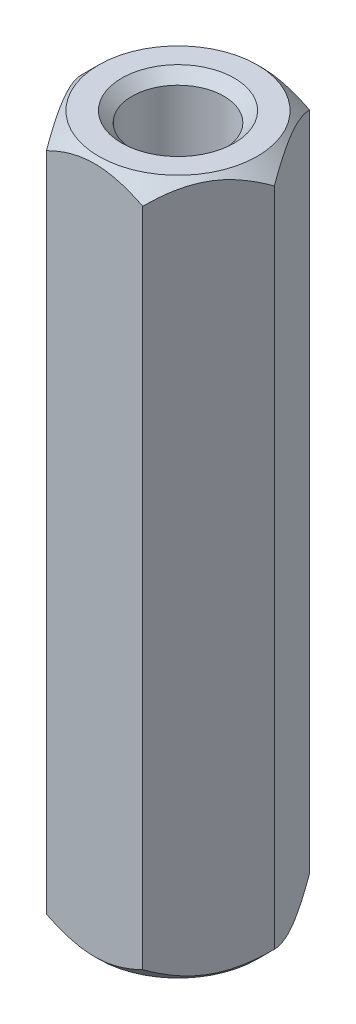
ISO-10303-21;
HEADER;
FILE_DESCRIPTION(('STEP AP214'),'2;1');
FILE_NAME('part.step','',(''),(''),'','','');
FILE_SCHEMA(('AUTOMOTIVE_DESIGN { 1 0 10303 214 1 1 1 1 }'));
ENDSEC;
DATA;
#1=APPLICATION_CONTEXT('core data for automotive mechanical design processes');
#2=APPLICATION_PROTOCOL_DEFINITION('international standard','automotive_design',2000,#1);
#3=PRODUCT_CONTEXT('',#1,'mechanical');
#4=PRODUCT('Part','Part','',(#3));
#5=PRODUCT_RELATED_PRODUCT_CATEGORY('part','',(#4));
#6=PRODUCT_DEFINITION_FORMATION('','',#4);
#7=PRODUCT_DEFINITION_CONTEXT('part definition',#1,'design');
#8=PRODUCT_DEFINITION('design','',#6,#7);
#9=PRODUCT_DEFINITION_SHAPE('','',#8);
#10=(LENGTH_UNIT() NAMED_UNIT(*) SI_UNIT(.MILLI.,.METRE.));
#11=(NAMED_UNIT(*) PLANE_ANGLE_UNIT() SI_UNIT($,.RADIAN.));
#12=(NAMED_UNIT(*) SI_UNIT($,.STERADIAN.) SOLID_ANGLE_UNIT());
#13=UNCERTAINTY_MEASURE_WITH_UNIT(LENGTH_MEASURE(1.E-05),#10,'distance_accuracy_value','');
#14=(GEOMETRIC_REPRESENTATION_CONTEXT(3) GLOBAL_UNCERTAINTY_ASSIGNED_CONTEXT((#13)) GLOBAL_UNIT_ASSIGNED_CONTEXT((#10,
#11,#12)) REPRESENTATION_CONTEXT('',''));
#15=CARTESIAN_POINT('',(0.,0.,0.));
#16=DIRECTION('',(0.,0.,1.));
#17=DIRECTION('',(1.,0.,0.));
#18=AXIS2_PLACEMENT_3D('',#15,#16,#17);
#19=CARTESIAN_POINT('',(3.46410161513775,25.,0.));
#20=DIRECTION('',(-0.866025403784438,0.,0.5));
#21=DIRECTION('',(0.5,0.,0.866025403784439));
#22=AXIS2_PLACEMENT_3D('',#19,#20,#21);
#23=PLANE('',#22);
#24=CARTESIAN_POINT('',(3.46421708519159,24.3857829090351,0.000199999999999765));
#25=CARTESIAN_POINT('',(3.40467869607211,24.4452700665405,-0.10292351495575));
#26=CARTESIAN_POINT('',(3.3441447475778,24.5012634053967,-0.207771389330652));
#27=CARTESIAN_POINT('',(3.22070940635329,24.6037857884833,-0.4215676717811));
#28=CARTESIAN_POINT('',(3.15779627521275,24.650257791121,-0.530536411379764));
#29=CARTESIAN_POINT('',(3.03093496880241,24.729865196346,-0.750266639597034));
#30=CARTESIAN_POINT('',(2.96701910000606,24.7632006842196,-0.860972171762219));
#31=CARTESIAN_POINT('',(2.83778025907546,24.8145608408829,-1.08482041056533));
#32=CARTESIAN_POINT('',(2.77246123486019,24.8326238473267,-1.197956279207));
#33=CARTESIAN_POINT('',(2.65988677911464,24.8489214764118,-1.39294095619271));
#34=CARTESIAN_POINT('',(2.6127767304643,24.8513340176884,-1.47453795400215));
#35=CARTESIAN_POINT('',(2.51863325954797,24.8472689502051,-1.6375992288301));
#36=CARTESIAN_POINT('',(2.47159986993093,24.8407882248339,-1.719063449299));
#37=CARTESIAN_POINT('',(2.37797867687425,24.819306662347,-1.88122011233839));
#38=CARTESIAN_POINT('',(2.33139143122688,24.804296294895,-1.96191158878432));
#39=CARTESIAN_POINT('',(2.23901705721437,24.7665747387962,-2.12190869789135));
#40=CARTESIAN_POINT('',(2.19322986779048,24.7438641405394,-2.20121443630932));
#41=CARTESIAN_POINT('',(2.11194373930152,24.6971377000083,-2.34200614080277));
#42=CARTESIAN_POINT('',(2.07626488907771,24.6743500571814,-2.40380372214604));
#43=CARTESIAN_POINT('',(2.00554773988154,24.6251020988048,-2.52628941752023));
#44=CARTESIAN_POINT('',(1.97050946049033,24.5986416711961,-2.58697749763562));
#45=CARTESIAN_POINT('',(1.90118383838355,24.5426413904709,-2.70705299739087));
#46=CARTESIAN_POINT('',(1.86689452386372,24.5131112203839,-2.76644383229592));
#47=CARTESIAN_POINT('',(1.79895094584794,24.4513592932867,-2.88412556146727));
#48=CARTESIAN_POINT('',(1.76529630793216,24.4191391882029,-2.94241710424774));
#49=CARTESIAN_POINT('',(1.73193533751504,24.3857829090351,-3.0002));
#50=B_SPLINE_CURVE_WITH_KNOTS('',3,(#24,#25,#26,#27,#28,#29,#30,#31,#32,#33,#34,#35,#36,#37,#38,
#39,#40,#41,#42,#43,#44,#45,#46,#47,#48,#49),.UNSPECIFIED.,.F.,.F.,(4,2,2,2,2,2,2,2,2,2,2,2,4),
(0.,0.399603557139309,0.80153528639785,1.19708369162344,1.59163620080174,1.87398941755845,
2.15644160919094,2.43921001247427,2.7219567403214,2.94657516661928,3.17120044767275,
3.3951375283781,3.61893808380739),.UNSPECIFIED.);
#51=CARTESIAN_POINT('',(3.46410161513775,24.3858983848623,0.));
#52=VERTEX_POINT('',#51);
#53=CARTESIAN_POINT('',(1.73205080756888,24.3858983848623,-3.));
#54=VERTEX_POINT('',#53);
#55=EDGE_CURVE('E193',#52,#54,#50,.T.);
#56=ORIENTED_EDGE('',*,*,#55,.F.);
#57=DIRECTION('',(0.,-1.,0.));
#58=VECTOR('',#57,1.);
#59=CARTESIAN_POINT('',(3.46410161513775,25.,0.));
#60=LINE('',#59,#58);
#61=CARTESIAN_POINT('',(3.46410161513775,0.614101615137745,0.));
#62=VERTEX_POINT('',#61);
#63=EDGE_CURVE('E58',#52,#62,#60,.T.);
#64=ORIENTED_EDGE('',*,*,#63,.T.);
#65=CARTESIAN_POINT('',(1.73193533751504,0.614217090964893,-3.0002));
#66=CARTESIAN_POINT('',(1.79147372663452,0.55472993345953,-2.89707648504425));
#67=CARTESIAN_POINT('',(1.85200767512883,0.498736594603263,-2.79222861066935));
#68=CARTESIAN_POINT('',(1.97544301635334,0.396214211516686,-2.5784323282189));
#69=CARTESIAN_POINT('',(2.03835614749388,0.349742208879036,-2.46946358862024));
#70=CARTESIAN_POINT('',(2.16521745390422,0.270134803654043,-2.24973336040297));
#71=CARTESIAN_POINT('',(2.22913332270057,0.236799315780413,-2.13902782823778));
#72=CARTESIAN_POINT('',(2.35837216363117,0.185439159117052,-1.91517958943467));
#73=CARTESIAN_POINT('',(2.42369118784644,0.16737615267335,-1.802043720793));
#74=CARTESIAN_POINT('',(2.53626564359199,0.151078523588245,-1.60705904380729));
#75=CARTESIAN_POINT('',(2.58337569224234,0.148665982311555,-1.52546204599786));
#76=CARTESIAN_POINT('',(2.67751916315866,0.152731049794863,-1.3624007711699));
#77=CARTESIAN_POINT('',(2.7245525527757,0.159211775166056,-1.280936550701));
#78=CARTESIAN_POINT('',(2.81817374583238,0.180693337652974,-1.11877988766161));
#79=CARTESIAN_POINT('',(2.86476099147975,0.19570370510503,-1.03808841121568));
#80=CARTESIAN_POINT('',(2.95713536549226,0.233425261203766,-0.878091302108648));
#81=CARTESIAN_POINT('',(3.00292255491615,0.256135859460584,-0.798785563690686));
#82=CARTESIAN_POINT('',(3.08420868340511,0.302862299991696,-0.65799385919723));
#83=CARTESIAN_POINT('',(3.11988753362892,0.325649942818551,-0.596196277853959));
#84=CARTESIAN_POINT('',(3.19060468282509,0.374897901195197,-0.473710582479769));
#85=CARTESIAN_POINT('',(3.2256429622163,0.401358328803947,-0.413022502364386));
#86=CARTESIAN_POINT('',(3.29496858432308,0.45735860952911,-0.29294700260913));
#87=CARTESIAN_POINT('',(3.32925789884291,0.486888779616117,-0.233556167704077));
#88=CARTESIAN_POINT('',(3.39720147685869,0.548640706713274,-0.115874438532729));
#89=CARTESIAN_POINT('',(3.43085611477447,0.580860811797101,-0.0575828957522647));
#90=CARTESIAN_POINT('',(3.46421708519159,0.614217090964893,0.000199999999999681));
#91=B_SPLINE_CURVE_WITH_KNOTS('',3,(#65,#66,#67,#68,#69,#70,#71,#72,#73,#74,#75,#76,#77,#78,#79,
#80,#81,#82,#83,#84,#85,#86,#87,#88,#89,#90),.UNSPECIFIED.,.F.,.F.,(4,2,2,2,2,2,2,2,2,2,2,2,4),
(0.,0.399603557139308,0.80153528639785,1.19708369162344,1.59163620080174,1.87398941755845,
2.15644160919094,2.43921001247427,2.7219567403214,2.94657516661928,3.17120044767275,
3.3951375283781,3.61893808380739),.UNSPECIFIED.);
#92=CARTESIAN_POINT('',(1.73205080756888,0.614101615137745,-3.));
#93=VERTEX_POINT('',#92);
#94=EDGE_CURVE('E127',#93,#62,#91,.T.);
#95=ORIENTED_EDGE('',*,*,#94,.F.);
#96=DIRECTION('',(0.,-1.,0.));
#97=VECTOR('',#96,1.);
#98=CARTESIAN_POINT('',(1.73205080756888,25.,-3.));
#99=LINE('',#98,#97);
#100=EDGE_CURVE('E11',#54,#93,#99,.T.);
#101=ORIENTED_EDGE('',*,*,#100,.F.);
#102=EDGE_LOOP('',(#56,#64,#95,#101));
#103=FACE_BOUND('',#102,.T.);
#104=ADVANCED_FACE('F35',(#103),#23,.F.);
#105=CARTESIAN_POINT('',(1.73205080756888,25.,-3.));
#106=DIRECTION('',(0.,0.,1.));
#107=DIRECTION('',(1.,0.,0.));
#108=AXIS2_PLACEMENT_3D('',#105,#106,#107);
#109=PLANE('',#108);
#110=CARTESIAN_POINT('',(-3.55437943290867,23.1988051908048,-3.));
#111=CARTESIAN_POINT('',(-3.46826992526424,23.2645940477752,-3.));
#112=CARTESIAN_POINT('',(-3.38168966142818,23.329776553131,-3.));
#113=CARTESIAN_POINT('',(-3.20739768747531,23.4586538844041,-3.));
#114=CARTESIAN_POINT('',(-3.11968570875569,23.5223483466762,-3.));
#115=CARTESIAN_POINT('',(-2.94229887171877,23.6484279524795,-3.));
#116=CARTESIAN_POINT('',(-2.85261408117447,23.7107991682434,-3.));
#117=CARTESIAN_POINT('',(-2.67174041937914,23.8333138384846,-3.));
#118=CARTESIAN_POINT('',(-2.58055165326809,23.8934574477436,-3.));
#119=CARTESIAN_POINT('',(-2.39080195811876,24.0146019961332,-3.));
#120=CARTESIAN_POINT('',(-2.29213080304534,24.0754311575962,-3.));
#121=CARTESIAN_POINT('',(-2.09247574185601,24.193231509697,-3.));
#122=CARTESIAN_POINT('',(-1.99149145864354,24.2502020652106,-3.));
#123=CARTESIAN_POINT('',(-1.78719628977717,24.3590658825323,-3.));
#124=CARTESIAN_POINT('',(-1.68389341673394,24.4109740632429,-3.));
#125=CARTESIAN_POINT('',(-1.47440493053288,24.5085504043716,-3.));
#126=CARTESIAN_POINT('',(-1.36822068497459,24.5542214651285,-3.));
#127=CARTESIAN_POINT('',(-1.16268584845238,24.6338354443881,-3.));
#128=CARTESIAN_POINT('',(-1.06360634930017,24.6684710649879,-3.));
#129=CARTESIAN_POINT('',(-0.862974540254709,24.729805843889,-3.));
#130=CARTESIAN_POINT('',(-0.76142206881605,24.7565044821989,-3.));
#131=CARTESIAN_POINT('',(-0.558189151338409,24.8000950069141,-3.));
#132=CARTESIAN_POINT('',(-0.456546721455128,24.817161192492,-3.));
#133=CARTESIAN_POINT('',(-0.252064582124884,24.8411395453682,-3.));
#134=CARTESIAN_POINT('',(-0.149225108306103,24.8480536780515,-3.));
#135=CARTESIAN_POINT('',(0.0524197257435041,24.8511668742879,-3.));
#136=CARTESIAN_POINT('',(0.151218621970646,24.8477912887221,-3.));
#137=CARTESIAN_POINT('',(0.348018063391401,24.831474763756,-3.));
#138=CARTESIAN_POINT('',(0.446018533212876,24.8185329316335,-3.));
#139=CARTESIAN_POINT('',(0.642170905922996,24.7835860432675,-3.));
#140=CARTESIAN_POINT('',(0.740294219756622,24.7614231600193,-3.));
#141=CARTESIAN_POINT('',(0.93438921180932,24.709245849315,-3.));
#142=CARTESIAN_POINT('',(1.03036103388649,24.6792319485224,-3.));
#143=CARTESIAN_POINT('',(1.22665734337668,24.6103006785078,-3.));
#144=CARTESIAN_POINT('',(1.32681200862059,24.5709049537266,-3.));
#145=CARTESIAN_POINT('',(1.52452378835025,24.4860448565337,-3.));
#146=CARTESIAN_POINT('',(1.62208004406085,24.4405785069126,-3.));
#147=CARTESIAN_POINT('',(1.81508211086305,24.3446486404722,-3.));
#148=CARTESIAN_POINT('',(1.91051997564909,24.2941692656765,-3.));
#149=CARTESIAN_POINT('',(2.09920364147711,24.1893299559348,-3.));
#150=CARTESIAN_POINT('',(2.19244982740395,24.1349707092118,-3.));
#151=CARTESIAN_POINT('',(2.37247316886372,24.0258974750244,-3.));
#152=CARTESIAN_POINT('',(2.45934210174786,23.9713341644982,-3.));
#153=CARTESIAN_POINT('',(2.63158782556355,23.8598941699806,-3.));
#154=CARTESIAN_POINT('',(2.71696450350811,23.8030173118931,-3.));
#155=CARTESIAN_POINT('',(2.88573246547333,23.6878284568633,-3.));
#156=CARTESIAN_POINT('',(2.96913420631436,23.6295317256256,-3.));
#157=CARTESIAN_POINT('',(3.134794927931,23.5113824090189,-3.));
#158=CARTESIAN_POINT('',(3.21705421719587,23.4515302566968,-3.));
#159=CARTESIAN_POINT('',(3.29883454254351,23.3910416755616,-3.));
#160=B_SPLINE_CURVE_WITH_KNOTS('',3,(#110,#111,#112,#113,#114,#115,#116,#117,#118,#119,#120,
#121,#122,#123,#124,#125,#126,#127,#128,#129,#130,#131,#132,#133,#134,#135,#136,#137,#138,#139,
#140,#141,#142,#143,#144,#145,#146,#147,#148,#149,#150,#151,#152,#153,#154,#155,#156,#157,#158,
#159),.UNSPECIFIED.,.F.,.F.,(4,2,2,2,2,2,2,2,2,2,2,2,2,2,2,2,2,2,2,2,2,2,2,2,4),(0.,
0.325101797915992,0.650282229676264,0.977976420213229,1.30564779858392,1.65332130479789,
2.00105189948722,2.34772462661146,2.69423559363915,3.00883908011693,3.32346317329883,
3.63219489537673,3.94086684070148,4.23695453077893,4.53306985524582,4.8344767603575,
5.1358634516173,5.45848743121098,5.78121674730408,6.10500162220173,6.42872920524588,
6.73643658919582,7.04416717134085,7.34941697924394,7.6545826938642),.UNSPECIFIED.);
#161=CARTESIAN_POINT('',(-1.73205080756888,24.3858983848623,-3.));
#162=VERTEX_POINT('',#161);
#163=EDGE_CURVE('E92',#54,#162,#160,.F.);
#164=ORIENTED_EDGE('',*,*,#163,.F.);
#165=ORIENTED_EDGE('',*,*,#100,.T.);
#166=CARTESIAN_POINT('',(-3.55437943290867,1.80119480919515,-3.));
#167=CARTESIAN_POINT('',(-3.46826992526423,1.73540595222484,-3.));
#168=CARTESIAN_POINT('',(-3.38168966142818,1.67022344686904,-3.));
#169=CARTESIAN_POINT('',(-3.20739768747531,1.54134611559592,-3.));
#170=CARTESIAN_POINT('',(-3.11968570875569,1.47765165332375,-3.));
#171=CARTESIAN_POINT('',(-2.94229887171877,1.3515720475205,-3.));
#172=CARTESIAN_POINT('',(-2.85261408117447,1.28920083175663,-3.));
#173=CARTESIAN_POINT('',(-2.67174041937914,1.16668616151537,-3.));
#174=CARTESIAN_POINT('',(-2.58055165326809,1.10654255225643,-3.));
#175=CARTESIAN_POINT('',(-2.39080195811876,0.985398003866796,-3.));
#176=CARTESIAN_POINT('',(-2.29213080304534,0.924568842403809,-3.));
#177=CARTESIAN_POINT('',(-2.09247574185601,0.806768490302959,-3.));
#178=CARTESIAN_POINT('',(-1.99149145864354,0.749797934789375,-3.));
#179=CARTESIAN_POINT('',(-1.78719628977717,0.640934117467747,-3.));
#180=CARTESIAN_POINT('',(-1.68389341673394,0.589025936757106,-3.));
#181=CARTESIAN_POINT('',(-1.47440493053288,0.491449595628359,-3.));
#182=CARTESIAN_POINT('',(-1.36822068497459,0.44577853487153,-3.));
#183=CARTESIAN_POINT('',(-1.16268584845238,0.366164555611857,-3.));
#184=CARTESIAN_POINT('',(-1.06360634930017,0.331528935012071,-3.));
#185=CARTESIAN_POINT('',(-0.86297454025471,0.270194156111035,-3.));
#186=CARTESIAN_POINT('',(-0.761422068816051,0.243495517801096,-3.));
#187=CARTESIAN_POINT('',(-0.55818915133841,0.199904993085947,-3.));
#188=CARTESIAN_POINT('',(-0.45654672145513,0.182838807508006,-3.));
#189=CARTESIAN_POINT('',(-0.252064582124886,0.15886045463181,-3.));
#190=CARTESIAN_POINT('',(-0.149225108306105,0.151946321948475,-3.));
#191=CARTESIAN_POINT('',(0.0524197257435016,0.148833125712148,-3.));
#192=CARTESIAN_POINT('',(0.151218621970643,0.152208711277874,-3.));
#193=CARTESIAN_POINT('',(0.348018063391399,0.168525236244028,-3.));
#194=CARTESIAN_POINT('',(0.446018533212874,0.181467068366496,-3.));
#195=CARTESIAN_POINT('',(0.642170905922994,0.216413956732535,-3.));
#196=CARTESIAN_POINT('',(0.74029421975662,0.238576839980691,-3.));
#197=CARTESIAN_POINT('',(0.934389211809317,0.29075415068495,-3.));
#198=CARTESIAN_POINT('',(1.03036103388648,0.320768051477617,-3.));
#199=CARTESIAN_POINT('',(1.22665734337668,0.389699321492169,-3.));
#200=CARTESIAN_POINT('',(1.32681200862059,0.429095046273443,-3.));
#201=CARTESIAN_POINT('',(1.52452378835025,0.513955143466322,-3.));
#202=CARTESIAN_POINT('',(1.62208004406085,0.559421493087399,-3.));
#203=CARTESIAN_POINT('',(1.81508211086305,0.655351359527786,-3.));
#204=CARTESIAN_POINT('',(1.91051997564909,0.705830734323499,-3.));
#205=CARTESIAN_POINT('',(2.09920364147711,0.810670044065214,-3.));
#206=CARTESIAN_POINT('',(2.19244982740395,0.86502929078816,-3.));
#207=CARTESIAN_POINT('',(2.37247316886372,0.974102524975637,-3.));
#208=CARTESIAN_POINT('',(2.45934210174786,1.0286658355018,-3.));
#209=CARTESIAN_POINT('',(2.63158782556354,1.14010583001939,-3.));
#210=CARTESIAN_POINT('',(2.71696450350811,1.19698268810694,-3.));
#211=CARTESIAN_POINT('',(2.88573246547333,1.31217154313671,-3.));
#212=CARTESIAN_POINT('',(2.96913420631436,1.37046827437444,-3.));
#213=CARTESIAN_POINT('',(3.134794927931,1.48861759098106,-3.));
#214=CARTESIAN_POINT('',(3.21705421719587,1.54846974330321,-3.));
#215=CARTESIAN_POINT('',(3.29883454254351,1.60895832443835,-3.));
#216=B_SPLINE_CURVE_WITH_KNOTS('',3,(#166,#167,#168,#169,#170,#171,#172,#173,#174,#175,#176,
#177,#178,#179,#180,#181,#182,#183,#184,#185,#186,#187,#188,#189,#190,#191,#192,#193,#194,#195,
#196,#197,#198,#199,#200,#201,#202,#203,#204,#205,#206,#207,#208,#209,#210,#211,#212,#213,#214,
#215),.UNSPECIFIED.,.F.,.F.,(4,2,2,2,2,2,2,2,2,2,2,2,2,2,2,2,2,2,2,2,2,2,2,2,4),(0.,
0.325101797915991,0.650282229676264,0.977976420213224,1.30564779858392,1.65332130479788,
2.00105189948722,2.34772462661146,2.69423559363914,3.00883908011693,3.32346317329883,
3.63219489537673,3.94086684070147,4.23695453077892,4.53306985524582,4.8344767603575,
5.1358634516173,5.45848743121098,5.78121674730408,6.10500162220173,6.42872920524587,
6.73643658919582,7.04416717134084,7.34941697924394,7.65458269386419),.UNSPECIFIED.);
#217=CARTESIAN_POINT('',(-1.73205080756888,0.614101615137745,-3.));
#218=VERTEX_POINT('',#217);
#219=EDGE_CURVE('E133',#218,#93,#216,.T.);
#220=ORIENTED_EDGE('',*,*,#219,.F.);
#221=DIRECTION('',(0.,-1.,0.));
#222=VECTOR('',#221,1.);
#223=CARTESIAN_POINT('',(-1.73205080756888,25.,-3.));
#224=LINE('',#223,#222);
#225=EDGE_CURVE('E43',#162,#218,#224,.T.);
#226=ORIENTED_EDGE('',*,*,#225,.F.);
#227=EDGE_LOOP('',(#164,#165,#220,#226));
#228=FACE_BOUND('',#227,.T.);
#229=ADVANCED_FACE('F177',(#228),#109,.F.);
#230=CARTESIAN_POINT('',(-1.73205080756888,25.,-3.));
#231=DIRECTION('',(0.866025403784439,0.,0.5));
#232=DIRECTION('',(0.5,0.,-0.866025403784439));
#233=AXIS2_PLACEMENT_3D('',#230,#231,#232);
#234=PLANE('',#233);
#235=CARTESIAN_POINT('',(-1.73193533751504,24.3857829090351,-3.0002));
#236=CARTESIAN_POINT('',(-1.79147372663452,24.4452700665405,-2.89707648504425));
#237=CARTESIAN_POINT('',(-1.85200767512883,24.5012634053967,-2.79222861066935));
#238=CARTESIAN_POINT('',(-1.97544301635334,24.6037857884833,-2.5784323282189));
#239=CARTESIAN_POINT('',(-2.03835614749388,24.650257791121,-2.46946358862024));
#240=CARTESIAN_POINT('',(-2.16521745390422,24.729865196346,-2.24973336040297));
#241=CARTESIAN_POINT('',(-2.22913332270057,24.7632006842196,-2.13902782823778));
#242=CARTESIAN_POINT('',(-2.35837216363117,24.8145608408829,-1.91517958943467));
#243=CARTESIAN_POINT('',(-2.42369118784644,24.8326238473266,-1.802043720793));
#244=CARTESIAN_POINT('',(-2.53626564359199,24.8489214764118,-1.60705904380729));
#245=CARTESIAN_POINT('',(-2.58337569224233,24.8513340176884,-1.52546204599786));
#246=CARTESIAN_POINT('',(-2.67751916315866,24.8472689502051,-1.3624007711699));
#247=CARTESIAN_POINT('',(-2.7245525527757,24.8407882248339,-1.280936550701));
#248=CARTESIAN_POINT('',(-2.81817374583238,24.819306662347,-1.11877988766162));
#249=CARTESIAN_POINT('',(-2.86476099147975,24.804296294895,-1.03808841121568));
#250=CARTESIAN_POINT('',(-2.95713536549226,24.7665747387962,-0.878091302108649));
#251=CARTESIAN_POINT('',(-3.00292255491615,24.7438641405394,-0.798785563690687));
#252=CARTESIAN_POINT('',(-3.08420868340511,24.6971377000083,-0.65799385919723));
#253=CARTESIAN_POINT('',(-3.11988753362892,24.6743500571815,-0.596196277853959));
#254=CARTESIAN_POINT('',(-3.19060468282508,24.6251020988048,-0.473710582479768));
#255=CARTESIAN_POINT('',(-3.2256429622163,24.5986416711961,-0.413022502364386));
#256=CARTESIAN_POINT('',(-3.29496858432308,24.5426413904709,-0.29294700260913));
#257=CARTESIAN_POINT('',(-3.32925789884291,24.5131112203839,-0.233556167704076));
#258=CARTESIAN_POINT('',(-3.39720147685869,24.4513592932867,-0.115874438532728));
#259=CARTESIAN_POINT('',(-3.43085611477447,24.4191391882029,-0.0575828957522634));
#260=CARTESIAN_POINT('',(-3.46421708519159,24.3857829090351,0.000200000000000844));
#261=B_SPLINE_CURVE_WITH_KNOTS('',3,(#235,#236,#237,#238,#239,#240,#241,#242,#243,#244,#245,
#246,#247,#248,#249,#250,#251,#252,#253,#254,#255,#256,#257,#258,#259,#260),.UNSPECIFIED.,.F.,
.F.,(4,2,2,2,2,2,2,2,2,2,2,2,4),(0.,0.399603557139308,0.801535286397849,1.19708369162344,
1.59163620080174,1.87398941755845,2.15644160919094,2.43921001247427,2.7219567403214,
2.94657516661928,3.17120044767275,3.3951375283781,3.61893808380739),.UNSPECIFIED.);
#262=CARTESIAN_POINT('',(-3.46410161513775,24.3858983848623,0.));
#263=VERTEX_POINT('',#262);
#264=EDGE_CURVE('E87',#162,#263,#261,.T.);
#265=ORIENTED_EDGE('',*,*,#264,.F.);
#266=ORIENTED_EDGE('',*,*,#225,.T.);
#267=CARTESIAN_POINT('',(-3.46421708519159,0.614217090964892,0.000200000000000906));
#268=CARTESIAN_POINT('',(-3.40467869607211,0.55472993345953,-0.102923514955748));
#269=CARTESIAN_POINT('',(-3.3441447475778,0.498736594603263,-0.20777138933065));
#270=CARTESIAN_POINT('',(-3.22070940635329,0.396214211516686,-0.421567671781098));
#271=CARTESIAN_POINT('',(-3.15779627521275,0.349742208879036,-0.530536411379762));
#272=CARTESIAN_POINT('',(-3.03093496880241,0.270134803654043,-0.750266639597033));
#273=CARTESIAN_POINT('',(-2.96701910000606,0.236799315780413,-0.860972171762216));
#274=CARTESIAN_POINT('',(-2.83778025907546,0.185439159117051,-1.08482041056533));
#275=CARTESIAN_POINT('',(-2.77246123486019,0.167376152673349,-1.197956279207));
#276=CARTESIAN_POINT('',(-2.65988677911464,0.151078523588245,-1.39294095619271));
#277=CARTESIAN_POINT('',(-2.6127767304643,0.148665982311555,-1.47453795400214));
#278=CARTESIAN_POINT('',(-2.51863325954797,0.152731049794862,-1.6375992288301));
#279=CARTESIAN_POINT('',(-2.47159986993093,0.159211775166055,-1.719063449299));
#280=CARTESIAN_POINT('',(-2.37797867687425,0.180693337652974,-1.88122011233838));
#281=CARTESIAN_POINT('',(-2.33139143122688,0.195703705105029,-1.96191158878432));
#282=CARTESIAN_POINT('',(-2.23901705721437,0.233425261203765,-2.12190869789135));
#283=CARTESIAN_POINT('',(-2.19322986779048,0.256135859460584,-2.20121443630931));
#284=CARTESIAN_POINT('',(-2.11194373930152,0.302862299991695,-2.34200614080277));
#285=CARTESIAN_POINT('',(-2.07626488907771,0.32564994281855,-2.40380372214604));
#286=CARTESIAN_POINT('',(-2.00554773988155,0.374897901195197,-2.52628941752023));
#287=CARTESIAN_POINT('',(-1.97050946049033,0.401358328803947,-2.58697749763561));
#288=CARTESIAN_POINT('',(-1.90118383838355,0.45735860952911,-2.70705299739087));
#289=CARTESIAN_POINT('',(-1.86689452386372,0.486888779616118,-2.76644383229592));
#290=CARTESIAN_POINT('',(-1.79895094584794,0.548640706713274,-2.88412556146727));
#291=CARTESIAN_POINT('',(-1.76529630793217,0.580860811797101,-2.94241710424774));
#292=CARTESIAN_POINT('',(-1.73193533751504,0.614217090964893,-3.0002));
#293=B_SPLINE_CURVE_WITH_KNOTS('',3,(#267,#268,#269,#270,#271,#272,#273,#274,#275,#276,#277,
#278,#279,#280,#281,#282,#283,#284,#285,#286,#287,#288,#289,#290,#291,#292),.UNSPECIFIED.,.F.,
.F.,(4,2,2,2,2,2,2,2,2,2,2,2,4),(0.,0.399603557139308,0.801535286397849,1.19708369162343,
1.59163620080174,1.87398941755845,2.15644160919094,2.43921001247427,2.7219567403214,
2.94657516661928,3.17120044767275,3.3951375283781,3.61893808380739),.UNSPECIFIED.);
#294=CARTESIAN_POINT('',(-3.46410161513775,0.614101615137745,0.));
#295=VERTEX_POINT('',#294);
#296=EDGE_CURVE('E108',#295,#218,#293,.T.);
#297=ORIENTED_EDGE('',*,*,#296,.F.);
#298=DIRECTION('',(0.,-1.,0.));
#299=VECTOR('',#298,1.);
#300=CARTESIAN_POINT('',(-3.46410161513775,25.,0.));
#301=LINE('',#300,#299);
#302=EDGE_CURVE('E101',#263,#295,#301,.T.);
#303=ORIENTED_EDGE('',*,*,#302,.F.);
#304=EDGE_LOOP('',(#265,#266,#297,#303));
#305=FACE_BOUND('',#304,.T.);
#306=ADVANCED_FACE('F106',(#305),#234,.F.);
#307=CARTESIAN_POINT('',(-3.46410161513775,25.,0.));
#308=DIRECTION('',(0.866025403784438,0.,-0.5));
#309=DIRECTION('',(-0.5,0.,-0.866025403784438));
#310=AXIS2_PLACEMENT_3D('',#307,#308,#309);
#311=PLANE('',#310);
#312=CARTESIAN_POINT('',(-3.46421708519159,24.3857829090351,-0.000199999999999094));
#313=CARTESIAN_POINT('',(-3.40467869607211,24.4452700665405,0.102923514955749));
#314=CARTESIAN_POINT('',(-3.3441447475778,24.5012634053967,0.207771389330652));
#315=CARTESIAN_POINT('',(-3.22070940635329,24.6037857884833,0.4215676717811));
#316=CARTESIAN_POINT('',(-3.15779627521275,24.650257791121,0.530536411379764));
#317=CARTESIAN_POINT('',(-3.03093496880241,24.729865196346,0.750266639597034));
#318=CARTESIAN_POINT('',(-2.96701910000606,24.7632006842196,0.860972171762218));
#319=CARTESIAN_POINT('',(-2.83778025907546,24.8145608408829,1.08482041056533));
#320=CARTESIAN_POINT('',(-2.77246123486019,24.8326238473266,1.197956279207));
#321=CARTESIAN_POINT('',(-2.65988677911464,24.8489214764118,1.39294095619271));
#322=CARTESIAN_POINT('',(-2.6127767304643,24.8513340176884,1.47453795400214));
#323=CARTESIAN_POINT('',(-2.51863325954797,24.8472689502051,1.6375992288301));
#324=CARTESIAN_POINT('',(-2.47159986993093,24.8407882248339,1.719063449299));
#325=CARTESIAN_POINT('',(-2.37797867687425,24.819306662347,1.88122011233838));
#326=CARTESIAN_POINT('',(-2.33139143122688,24.804296294895,1.96191158878432));
#327=CARTESIAN_POINT('',(-2.23901705721437,24.7665747387962,2.12190869789135));
#328=CARTESIAN_POINT('',(-2.19322986779048,24.7438641405394,2.20121443630931));
#329=CARTESIAN_POINT('',(-2.11194373930152,24.6971377000083,2.34200614080277));
#330=CARTESIAN_POINT('',(-2.07626488907771,24.6743500571815,2.40380372214604));
#331=CARTESIAN_POINT('',(-2.00554773988154,24.6251020988048,2.52628941752023));
#332=CARTESIAN_POINT('',(-1.97050946049033,24.5986416711961,2.58697749763561));
#333=CARTESIAN_POINT('',(-1.90118383838355,24.5426413904709,2.70705299739087));
#334=CARTESIAN_POINT('',(-1.86689452386372,24.5131112203839,2.76644383229592));
#335=CARTESIAN_POINT('',(-1.79895094584794,24.4513592932867,2.88412556146727));
#336=CARTESIAN_POINT('',(-1.76529630793216,24.4191391882029,2.94241710424774));
#337=CARTESIAN_POINT('',(-1.73193533751504,24.3857829090351,3.0002));
#338=B_SPLINE_CURVE_WITH_KNOTS('',3,(#312,#313,#314,#315,#316,#317,#318,#319,#320,#321,#322,
#323,#324,#325,#326,#327,#328,#329,#330,#331,#332,#333,#334,#335,#336,#337),.UNSPECIFIED.,.F.,
.F.,(4,2,2,2,2,2,2,2,2,2,2,2,4),(0.,0.39960355713931,0.801535286397849,1.19708369162344,
1.59163620080174,1.87398941755845,2.15644160919094,2.43921001247427,2.7219567403214,
2.94657516661928,3.17120044767275,3.3951375283781,3.61893808380739),.UNSPECIFIED.);
#339=CARTESIAN_POINT('',(-1.73205080756887,24.3858983848623,3.));
#340=VERTEX_POINT('',#339);
#341=EDGE_CURVE('E90',#263,#340,#338,.T.);
#342=ORIENTED_EDGE('',*,*,#341,.F.);
#343=ORIENTED_EDGE('',*,*,#302,.T.);
#344=CARTESIAN_POINT('',(-1.73193533751504,0.614217090964892,3.0002));
#345=CARTESIAN_POINT('',(-1.79147372663452,0.55472993345953,2.89707648504425));
#346=CARTESIAN_POINT('',(-1.85200767512883,0.498736594603263,2.79222861066935));
#347=CARTESIAN_POINT('',(-1.97544301635334,0.396214211516686,2.5784323282189));
#348=CARTESIAN_POINT('',(-2.03835614749388,0.349742208879036,2.46946358862024));
#349=CARTESIAN_POINT('',(-2.16521745390422,0.270134803654043,2.24973336040297));
#350=CARTESIAN_POINT('',(-2.22913332270057,0.236799315780413,2.13902782823778));
#351=CARTESIAN_POINT('',(-2.35837216363117,0.185439159117051,1.91517958943467));
#352=CARTESIAN_POINT('',(-2.42369118784644,0.167376152673349,1.802043720793));
#353=CARTESIAN_POINT('',(-2.53626564359199,0.151078523588244,1.60705904380729));
#354=CARTESIAN_POINT('',(-2.58337569224233,0.148665982311555,1.52546204599786));
#355=CARTESIAN_POINT('',(-2.67751916315866,0.152731049794862,1.3624007711699));
#356=CARTESIAN_POINT('',(-2.7245525527757,0.159211775166055,1.280936550701));
#357=CARTESIAN_POINT('',(-2.81817374583238,0.180693337652973,1.11877988766162));
#358=CARTESIAN_POINT('',(-2.86476099147975,0.195703705105029,1.03808841121568));
#359=CARTESIAN_POINT('',(-2.95713536549226,0.233425261203765,0.878091302108649));
#360=CARTESIAN_POINT('',(-3.00292255491615,0.256135859460583,0.798785563690687));
#361=CARTESIAN_POINT('',(-3.08420868340511,0.302862299991695,0.657993859197231));
#362=CARTESIAN_POINT('',(-3.11988753362892,0.32564994281855,0.59619627785396));
#363=CARTESIAN_POINT('',(-3.19060468282508,0.374897901195196,0.47371058247977));
#364=CARTESIAN_POINT('',(-3.2256429622163,0.401358328803946,0.413022502364387));
#365=CARTESIAN_POINT('',(-3.29496858432308,0.457358609529109,0.292947002609131));
#366=CARTESIAN_POINT('',(-3.32925789884291,0.486888779616116,0.233556167704077));
#367=CARTESIAN_POINT('',(-3.39720147685869,0.548640706713273,0.115874438532729));
#368=CARTESIAN_POINT('',(-3.43085611477447,0.5808608117971,0.0575828957522654));
#369=CARTESIAN_POINT('',(-3.46421708519159,0.614217090964892,-0.000199999999999004));
#370=B_SPLINE_CURVE_WITH_KNOTS('',3,(#344,#345,#346,#347,#348,#349,#350,#351,#352,#353,#354,
#355,#356,#357,#358,#359,#360,#361,#362,#363,#364,#365,#366,#367,#368,#369),.UNSPECIFIED.,.F.,
.F.,(4,2,2,2,2,2,2,2,2,2,2,2,4),(0.,0.399603557139309,0.80153528639785,1.19708369162343,
1.59163620080174,1.87398941755845,2.15644160919094,2.43921001247427,2.7219567403214,
2.94657516661928,3.17120044767275,3.3951375283781,3.61893808380739),.UNSPECIFIED.);
#371=CARTESIAN_POINT('',(-1.73205080756888,0.614101615137745,3.));
#372=VERTEX_POINT('',#371);
#373=EDGE_CURVE('E166',#372,#295,#370,.T.);
#374=ORIENTED_EDGE('',*,*,#373,.F.);
#375=DIRECTION('',(0.,-1.,0.));
#376=VECTOR('',#375,1.);
#377=CARTESIAN_POINT('',(-1.73205080756888,25.,3.));
#378=LINE('',#377,#376);
#379=EDGE_CURVE('E103',#340,#372,#378,.T.);
#380=ORIENTED_EDGE('',*,*,#379,.F.);
#381=EDGE_LOOP('',(#342,#343,#374,#380));
#382=FACE_BOUND('',#381,.T.);
#383=ADVANCED_FACE('F99',(#382),#311,.F.);
#384=CARTESIAN_POINT('',(-1.73205080756888,25.,3.));
#385=DIRECTION('',(0.,0.,-1.));
#386=DIRECTION('',(-1.,0.,0.));
#387=AXIS2_PLACEMENT_3D('',#384,#385,#386);
#388=PLANE('',#387);
#389=CARTESIAN_POINT('',(-3.55437943293618,23.1988051907838,3.));
#390=CARTESIAN_POINT('',(-3.46826992529096,23.2645940477549,3.));
#391=CARTESIAN_POINT('',(-3.38168966145412,23.3297765531116,3.));
#392=CARTESIAN_POINT('',(-3.20739768749967,23.4586538843863,3.));
#393=CARTESIAN_POINT('',(-3.11968570877925,23.5223483466593,3.));
#394=CARTESIAN_POINT('',(-2.94229887174071,23.6484279524641,3.));
#395=CARTESIAN_POINT('',(-2.85261408119559,23.7107991682288,3.));
#396=CARTESIAN_POINT('',(-2.6717404193986,23.8333138384717,3.));
#397=CARTESIAN_POINT('',(-2.58055165328671,23.8934574477314,3.));
#398=CARTESIAN_POINT('',(-2.39080195813558,24.0146019961227,3.));
#399=CARTESIAN_POINT('',(-2.29213080306118,24.0754311575866,3.));
#400=CARTESIAN_POINT('',(-2.09247574186987,24.1932315096891,3.));
#401=CARTESIAN_POINT('',(-1.99149145865639,24.2502020652035,3.));
#402=CARTESIAN_POINT('',(-1.78719628978797,24.3590658825267,3.));
#403=CARTESIAN_POINT('',(-1.6838934167437,24.4109740632381,3.));
#404=CARTESIAN_POINT('',(-1.4744049305405,24.5085504043683,3.));
#405=CARTESIAN_POINT('',(-1.36822068498111,24.5542214651258,3.));
#406=CARTESIAN_POINT('',(-1.16268584845843,24.6338354443859,3.));
#407=CARTESIAN_POINT('',(-1.06360634930691,24.6684710649857,3.));
#408=CARTESIAN_POINT('',(-0.862974540262839,24.7298058438867,3.));
#409=CARTESIAN_POINT('',(-0.761422068824888,24.7565044821967,3.));
#410=CARTESIAN_POINT('',(-0.558189151348641,24.8000950069122,3.));
#411=CARTESIAN_POINT('',(-0.456546721466045,24.8171611924903,3.));
#412=CARTESIAN_POINT('',(-0.252064582137153,24.8411395453671,3.));
#413=CARTESIAN_POINT('',(-0.149225108319037,24.8480536780509,3.));
#414=CARTESIAN_POINT('',(0.0524197257294018,24.8511668742881,3.));
#415=CARTESIAN_POINT('',(0.151218621956039,24.8477912887228,3.));
#416=CARTESIAN_POINT('',(0.348018063375839,24.8314747637578,3.));
#417=CARTESIAN_POINT('',(0.446018533196864,24.8185329316359,3.));
#418=CARTESIAN_POINT('',(0.642170905906096,24.783586043271,3.));
#419=CARTESIAN_POINT('',(0.740294219739286,24.7614231600235,3.));
#420=CARTESIAN_POINT('',(0.934389211791154,24.7092458493204,3.));
#421=CARTESIAN_POINT('',(1.03036103386793,24.6792319485284,3.));
#422=CARTESIAN_POINT('',(1.22665734335595,24.6103006785156,3.));
#423=CARTESIAN_POINT('',(1.32681200859811,24.5709049537356,3.));
#424=CARTESIAN_POINT('',(1.52452378832436,24.4860448565454,3.));
#425=CARTESIAN_POINT('',(1.6220800440333,24.4405785069257,3.));
#426=CARTESIAN_POINT('',(1.81508211083225,24.3446486404881,3.));
#427=CARTESIAN_POINT('',(1.91051997561669,24.2941692656939,3.));
#428=CARTESIAN_POINT('',(2.09920364144157,24.1893299559551,3.));
#429=CARTESIAN_POINT('',(2.19244982736686,24.1349707092337,3.));
#430=CARTESIAN_POINT('',(2.37247316882382,24.0258974750491,3.));
#431=CARTESIAN_POINT('',(2.4593421017067,23.9713341645243,3.));
#432=CARTESIAN_POINT('',(2.63158782551987,23.8598941700094,3.));
#433=CARTESIAN_POINT('',(2.71696450346319,23.8030173119232,3.));
#434=CARTESIAN_POINT('',(2.88573246542594,23.6878284568961,3.));
#435=CARTESIAN_POINT('',(2.96913420626575,23.6295317256598,3.));
#436=CARTESIAN_POINT('',(3.13479492787996,23.5113824090558,3.));
#437=CARTESIAN_POINT('',(3.21705421714362,23.451530256735,3.));
#438=CARTESIAN_POINT('',(3.29883454249005,23.3910416756012,3.));
#439=B_SPLINE_CURVE_WITH_KNOTS('',3,(#389,#390,#391,#392,#393,#394,#395,#396,#397,#398,#399,
#400,#401,#402,#403,#404,#405,#406,#407,#408,#409,#410,#411,#412,#413,#414,#415,#416,#417,#418,
#419,#420,#421,#422,#423,#424,#425,#426,#427,#428,#429,#430,#431,#432,#433,#434,#435,#436,#437,
#438),.UNSPECIFIED.,.F.,.F.,(4,2,2,2,2,2,2,2,2,2,2,2,2,2,2,2,2,2,2,2,2,2,2,2,4),(0.,
0.325101797919344,0.650282229682973,0.977976420223354,1.30564779859747,1.65332130481527,
2.00105189950845,2.3477246266365,2.69423559366799,3.00883908014379,3.3234631733237,
3.63219489539969,3.94086684072254,4.23695453079843,4.53306985526377,4.83447676037376,
5.13586345163187,5.45848743121931,5.78121674730615,6.10500162219751,6.42872920523537,
6.73643658917994,7.04416717131959,7.34941697921738,7.65458269383234),.UNSPECIFIED.);
#440=CARTESIAN_POINT('',(1.73205080756888,24.3858983848623,3.));
#441=VERTEX_POINT('',#440);
#442=EDGE_CURVE('E50',#340,#441,#439,.T.);
#443=ORIENTED_EDGE('',*,*,#442,.F.);
#444=ORIENTED_EDGE('',*,*,#379,.T.);
#445=CARTESIAN_POINT('',(-3.55437943293618,1.80119480921618,3.));
#446=CARTESIAN_POINT('',(-3.46826992529097,1.73540595224506,3.));
#447=CARTESIAN_POINT('',(-3.38168966145412,1.67022344688844,3.));
#448=CARTESIAN_POINT('',(-3.20739768749967,1.5413461156137,3.));
#449=CARTESIAN_POINT('',(-3.11968570877925,1.47765165334074,3.));
#450=CARTESIAN_POINT('',(-2.94229887174072,1.35157204753587,3.));
#451=CARTESIAN_POINT('',(-2.85261408119559,1.28920083177118,3.));
#452=CARTESIAN_POINT('',(-2.6717404193986,1.16668616152831,3.));
#453=CARTESIAN_POINT('',(-2.58055165328672,1.10654255226857,3.));
#454=CARTESIAN_POINT('',(-2.39080195813558,0.985398003877267,3.));
#455=CARTESIAN_POINT('',(-2.29213080306118,0.924568842413417,3.));
#456=CARTESIAN_POINT('',(-2.09247574186987,0.806768490310878,3.));
#457=CARTESIAN_POINT('',(-1.99149145865639,0.74979793479647,3.));
#458=CARTESIAN_POINT('',(-1.78719628978797,0.640934117473262,3.));
#459=CARTESIAN_POINT('',(-1.6838934167437,0.589025936761864,3.));
#460=CARTESIAN_POINT('',(-1.4744049305405,0.491449595631699,3.));
#461=CARTESIAN_POINT('',(-1.36822068498111,0.445778534874207,3.));
#462=CARTESIAN_POINT('',(-1.16268584845844,0.366164555614065,3.));
#463=CARTESIAN_POINT('',(-1.06360634930691,0.331528935014347,3.));
#464=CARTESIAN_POINT('',(-0.86297454026284,0.270194156113306,3.));
#465=CARTESIAN_POINT('',(-0.761422068824889,0.243495517803296,3.));
#466=CARTESIAN_POINT('',(-0.558189151348642,0.199904993087843,3.));
#467=CARTESIAN_POINT('',(-0.456546721466047,0.182838807509674,3.));
#468=CARTESIAN_POINT('',(-0.252064582137154,0.158860454632862,3.));
#469=CARTESIAN_POINT('',(-0.149225108319038,0.15194632194914,3.));
#470=CARTESIAN_POINT('',(0.0524197257294007,0.148833125711919,3.));
#471=CARTESIAN_POINT('',(0.151218621956038,0.152208711277152,3.));
#472=CARTESIAN_POINT('',(0.348018063375839,0.168525236242248,3.));
#473=CARTESIAN_POINT('',(0.446018533196864,0.181467068364151,3.));
#474=CARTESIAN_POINT('',(0.642170905906096,0.216413956729008,3.));
#475=CARTESIAN_POINT('',(0.740294219739285,0.238576839976543,3.));
#476=CARTESIAN_POINT('',(0.934389211791153,0.290754150679554,3.));
#477=CARTESIAN_POINT('',(1.03036103386793,0.320768051471592,3.));
#478=CARTESIAN_POINT('',(1.22665734335594,0.389699321484361,3.));
#479=CARTESIAN_POINT('',(1.32681200859811,0.42909504626438,3.));
#480=CARTESIAN_POINT('',(1.52452378832436,0.513955143454624,3.));
#481=CARTESIAN_POINT('',(1.6220800440333,0.55942149307432,3.));
#482=CARTESIAN_POINT('',(1.81508211083224,0.655351359511863,3.));
#483=CARTESIAN_POINT('',(1.91051997561669,0.70583073430611,3.));
#484=CARTESIAN_POINT('',(2.09920364144156,0.81067004404485,3.));
#485=CARTESIAN_POINT('',(2.19244982736686,0.865029290766286,3.));
#486=CARTESIAN_POINT('',(2.37247316882382,0.974102524950895,3.));
#487=CARTESIAN_POINT('',(2.45934210170669,1.02866583547571,3.));
#488=CARTESIAN_POINT('',(2.63158782551987,1.14010582999059,3.));
#489=CARTESIAN_POINT('',(2.71696450346318,1.19698268807678,3.));
#490=CARTESIAN_POINT('',(2.88573246542593,1.31217154310385,3.));
#491=CARTESIAN_POINT('',(2.96913420626575,1.37046827434024,3.));
#492=CARTESIAN_POINT('',(3.13479492787996,1.48861759094418,3.));
#493=CARTESIAN_POINT('',(3.21705421714362,1.548469743265,3.));
#494=CARTESIAN_POINT('',(3.29883454249005,1.6089583243988,3.));
#495=B_SPLINE_CURVE_WITH_KNOTS('',3,(#445,#446,#447,#448,#449,#450,#451,#452,#453,#454,#455,
#456,#457,#458,#459,#460,#461,#462,#463,#464,#465,#466,#467,#468,#469,#470,#471,#472,#473,#474,
#475,#476,#477,#478,#479,#480,#481,#482,#483,#484,#485,#486,#487,#488,#489,#490,#491,#492,#493,
#494),.UNSPECIFIED.,.F.,.F.,(4,2,2,2,2,2,2,2,2,2,2,2,2,2,2,2,2,2,2,2,2,2,2,2,4),(0.,
0.325101797919346,0.650282229682974,0.977976420223355,1.30564779859747,1.65332130481527,
2.00105189950845,2.3477246266365,2.69423559366799,3.00883908014379,3.3234631733237,
3.63219489539969,3.94086684072254,4.23695453079843,4.53306985526377,4.83447676037376,
5.13586345163187,5.45848743121931,5.78121674730615,6.10500162219751,6.42872920523537,
6.73643658917994,7.04416717131959,7.34941697921738,7.65458269383234),.UNSPECIFIED.);
#496=CARTESIAN_POINT('',(1.73205080756888,0.614101615137745,3.));
#497=VERTEX_POINT('',#496);
#498=EDGE_CURVE('E159',#497,#372,#495,.F.);
#499=ORIENTED_EDGE('',*,*,#498,.F.);
#500=DIRECTION('',(0.,-1.,0.));
#501=VECTOR('',#500,1.);
#502=CARTESIAN_POINT('',(1.73205080756888,25.,3.));
#503=LINE('',#502,#501);
#504=EDGE_CURVE('E110',#441,#497,#503,.T.);
#505=ORIENTED_EDGE('',*,*,#504,.F.);
#506=EDGE_LOOP('',(#443,#444,#499,#505));
#507=FACE_BOUND('',#506,.T.);
#508=ADVANCED_FACE('F214',(#507),#388,.F.);
#509=CARTESIAN_POINT('',(1.73205080756888,25.,3.));
#510=DIRECTION('',(-0.866025403784439,0.,-0.5));
#511=DIRECTION('',(-0.5,0.,0.866025403784439));
#512=AXIS2_PLACEMENT_3D('',#509,#510,#511);
#513=PLANE('',#512);
#514=CARTESIAN_POINT('',(1.73193533751504,24.3857829090351,3.0002));
#515=CARTESIAN_POINT('',(1.79147372663452,24.4452700665405,2.89707648504425));
#516=CARTESIAN_POINT('',(1.85200767512883,24.5012634053967,2.79222861066935));
#517=CARTESIAN_POINT('',(1.97544301635334,24.6037857884833,2.5784323282189));
#518=CARTESIAN_POINT('',(2.03835614749388,24.650257791121,2.46946358862024));
#519=CARTESIAN_POINT('',(2.16521745390422,24.729865196346,2.24973336040297));
#520=CARTESIAN_POINT('',(2.22913332270057,24.7632006842196,2.13902782823778));
#521=CARTESIAN_POINT('',(2.35837216363117,24.8145608408829,1.91517958943467));
#522=CARTESIAN_POINT('',(2.42369118784644,24.8326238473266,1.802043720793));
#523=CARTESIAN_POINT('',(2.536265643592,24.8489214764118,1.60705904380729));
#524=CARTESIAN_POINT('',(2.58337569224234,24.8513340176884,1.52546204599785));
#525=CARTESIAN_POINT('',(2.67751916315866,24.8472689502051,1.3624007711699));
#526=CARTESIAN_POINT('',(2.7245525527757,24.8407882248339,1.280936550701));
#527=CARTESIAN_POINT('',(2.81817374583238,24.819306662347,1.11877988766161));
#528=CARTESIAN_POINT('',(2.86476099147975,24.804296294895,1.03808841121568));
#529=CARTESIAN_POINT('',(2.95713536549226,24.7665747387962,0.878091302108647));
#530=CARTESIAN_POINT('',(3.00292255491615,24.7438641405394,0.798785563690685));
#531=CARTESIAN_POINT('',(3.08420868340511,24.6971377000083,0.65799385919723));
#532=CARTESIAN_POINT('',(3.11988753362892,24.6743500571814,0.596196277853959));
#533=CARTESIAN_POINT('',(3.19060468282509,24.6251020988048,0.473710582479769));
#534=CARTESIAN_POINT('',(3.2256429622163,24.5986416711961,0.413022502364387));
#535=CARTESIAN_POINT('',(3.29496858432308,24.5426413904709,0.29294700260913));
#536=CARTESIAN_POINT('',(3.32925789884291,24.5131112203839,0.233556167704076));
#537=CARTESIAN_POINT('',(3.39720147685869,24.4513592932867,0.115874438532729));
#538=CARTESIAN_POINT('',(3.43085611477447,24.4191391882029,0.0575828957522651));
#539=CARTESIAN_POINT('',(3.46421708519159,24.3857829090351,-0.000199999999999283));
#540=B_SPLINE_CURVE_WITH_KNOTS('',3,(#514,#515,#516,#517,#518,#519,#520,#521,#522,#523,#524,
#525,#526,#527,#528,#529,#530,#531,#532,#533,#534,#535,#536,#537,#538,#539),.UNSPECIFIED.,.F.,
.F.,(4,2,2,2,2,2,2,2,2,2,2,2,4),(0.,0.399603557139308,0.801535286397848,1.19708369162344,
1.59163620080174,1.87398941755846,2.15644160919094,2.43921001247427,2.7219567403214,
2.94657516661928,3.17120044767275,3.3951375283781,3.61893808380739),.UNSPECIFIED.);
#541=EDGE_CURVE('E212',#441,#52,#540,.T.);
#542=ORIENTED_EDGE('',*,*,#541,.F.);
#543=ORIENTED_EDGE('',*,*,#504,.T.);
#544=CARTESIAN_POINT('',(3.46421708519159,0.614217090964893,-0.000200000000000235));
#545=CARTESIAN_POINT('',(3.40467869607211,0.55472993345953,0.102923514955749));
#546=CARTESIAN_POINT('',(3.3441447475778,0.498736594603264,0.207771389330652));
#547=CARTESIAN_POINT('',(3.22070940635329,0.396214211516687,0.421567671781099));
#548=CARTESIAN_POINT('',(3.15779627521275,0.349742208879037,0.530536411379764));
#549=CARTESIAN_POINT('',(3.03093496880241,0.270134803654044,0.750266639597034));
#550=CARTESIAN_POINT('',(2.96701910000606,0.236799315780414,0.860972171762218));
#551=CARTESIAN_POINT('',(2.83778025907546,0.185439159117052,1.08482041056533));
#552=CARTESIAN_POINT('',(2.77246123486019,0.16737615267335,1.197956279207));
#553=CARTESIAN_POINT('',(2.65988677911464,0.151078523588245,1.39294095619271));
#554=CARTESIAN_POINT('',(2.6127767304643,0.148665982311556,1.47453795400214));
#555=CARTESIAN_POINT('',(2.51863325954797,0.152731049794863,1.6375992288301));
#556=CARTESIAN_POINT('',(2.47159986993093,0.159211775166056,1.719063449299));
#557=CARTESIAN_POINT('',(2.37797867687425,0.180693337652974,1.88122011233839));
#558=CARTESIAN_POINT('',(2.33139143122688,0.195703705105031,1.96191158878432));
#559=CARTESIAN_POINT('',(2.23901705721437,0.233425261203767,2.12190869789135));
#560=CARTESIAN_POINT('',(2.19322986779048,0.256135859460585,2.20121443630932));
#561=CARTESIAN_POINT('',(2.11194373930152,0.302862299991697,2.34200614080277));
#562=CARTESIAN_POINT('',(2.07626488907771,0.325649942818552,2.40380372214604));
#563=CARTESIAN_POINT('',(2.00554773988155,0.374897901195198,2.52628941752023));
#564=CARTESIAN_POINT('',(1.97050946049033,0.401358328803948,2.58697749763561));
#565=CARTESIAN_POINT('',(1.90118383838355,0.45735860952911,2.70705299739087));
#566=CARTESIAN_POINT('',(1.86689452386372,0.486888779616118,2.76644383229592));
#567=CARTESIAN_POINT('',(1.79895094584795,0.548640706713275,2.88412556146727));
#568=CARTESIAN_POINT('',(1.76529630793217,0.580860811797101,2.94241710424774));
#569=CARTESIAN_POINT('',(1.73193533751504,0.614217090964893,3.0002));
#570=B_SPLINE_CURVE_WITH_KNOTS('',3,(#544,#545,#546,#547,#548,#549,#550,#551,#552,#553,#554,
#555,#556,#557,#558,#559,#560,#561,#562,#563,#564,#565,#566,#567,#568,#569),.UNSPECIFIED.,.F.,
.F.,(4,2,2,2,2,2,2,2,2,2,2,2,4),(0.,0.399603557139309,0.80153528639785,1.19708369162344,
1.59163620080174,1.87398941755845,2.15644160919094,2.43921001247427,2.7219567403214,
2.94657516661928,3.17120044767275,3.3951375283781,3.61893808380739),.UNSPECIFIED.);
#571=EDGE_CURVE('E150',#62,#497,#570,.T.);
#572=ORIENTED_EDGE('',*,*,#571,.F.);
#573=ORIENTED_EDGE('',*,*,#63,.F.);
#574=EDGE_LOOP('',(#542,#543,#572,#573));
#575=FACE_BOUND('',#574,.T.);
#576=ADVANCED_FACE('F210',(#575),#513,.F.);
#577=CARTESIAN_POINT('',(0.,25.,0.));
#578=DIRECTION('',(0.,1.,0.));
#579=DIRECTION('',(0.,0.,1.));
#580=AXIS2_PLACEMENT_3D('',#577,#578,#579);
#581=PLANE('',#580);
#582=CARTESIAN_POINT('',(0.,25.,0.));
#583=DIRECTION('',(0.,1.,0.));
#584=DIRECTION('',(0.,0.,1.));
#585=AXIS2_PLACEMENT_3D('',#582,#583,#584);
#586=CIRCLE('',#585,2.025);
#587=CARTESIAN_POINT('',(0.,25.,2.025));
#588=VERTEX_POINT('',#587);
#589=EDGE_CURVE('E121',#588,#588,#586,.T.);
#590=ORIENTED_EDGE('',*,*,#589,.F.);
#591=EDGE_LOOP('',(#590));
#592=FACE_BOUND('',#591,.T.);
#593=CARTESIAN_POINT('',(0.,25.,0.));
#594=DIRECTION('',(0.,1.,0.));
#595=DIRECTION('',(-1.,0.,0.));
#596=AXIS2_PLACEMENT_3D('',#593,#594,#595);
#597=CIRCLE('',#596,2.85);
#598=CARTESIAN_POINT('',(-2.85,25.,0.));
#599=VERTEX_POINT('',#598);
#600=EDGE_CURVE('E215',#599,#599,#597,.T.);
#601=ORIENTED_EDGE('',*,*,#600,.T.);
#602=EDGE_LOOP('',(#601));
#603=FACE_BOUND('',#602,.T.);
#604=ADVANCED_FACE('F230',(#592,#603),#581,.T.);
#605=CARTESIAN_POINT('',(0.,0.,0.));
#606=DIRECTION('',(0.,1.,0.));
#607=DIRECTION('',(0.,0.,1.));
#608=AXIS2_PLACEMENT_3D('',#605,#606,#607);
#609=PLANE('',#608);
#610=CARTESIAN_POINT('',(0.,0.,0.));
#611=DIRECTION('',(0.,1.,0.));
#612=DIRECTION('',(0.,0.,1.));
#613=AXIS2_PLACEMENT_3D('',#610,#611,#612);
#614=CIRCLE('',#613,2.02499999999999);
#615=CARTESIAN_POINT('',(0.,0.,2.02499999999999));
#616=VERTEX_POINT('',#615);
#617=EDGE_CURVE('E124',#616,#616,#614,.T.);
#618=ORIENTED_EDGE('',*,*,#617,.T.);
#619=EDGE_LOOP('',(#618));
#620=FACE_BOUND('',#619,.T.);
#621=CARTESIAN_POINT('',(0.,0.,0.));
#622=DIRECTION('',(0.,1.,0.));
#623=DIRECTION('',(-1.,0.,0.));
#624=AXIS2_PLACEMENT_3D('',#621,#622,#623);
#625=CIRCLE('',#624,2.85);
#626=CARTESIAN_POINT('',(-2.85,0.,0.));
#627=VERTEX_POINT('',#626);
#628=EDGE_CURVE('E197',#627,#627,#625,.T.);
#629=ORIENTED_EDGE('',*,*,#628,.F.);
#630=EDGE_LOOP('',(#629));
#631=FACE_BOUND('',#630,.T.);
#632=ADVANCED_FACE('F231',(#620,#631),#609,.F.);
#633=CARTESIAN_POINT('',(0.,0.375000000000004,0.));
#634=DIRECTION('',(0.,-1.,0.));
#635=DIRECTION('',(0.,0.,-1.));
#636=AXIS2_PLACEMENT_3D('',#633,#634,#635);
#637=CONICAL_SURFACE('',#636,1.64999999999999,0.785398163397448);
#638=ORIENTED_EDGE('',*,*,#617,.F.);
#639=EDGE_LOOP('',(#638));
#640=FACE_BOUND('',#639,.T.);
#641=CARTESIAN_POINT('',(0.,0.375000000000004,0.));
#642=DIRECTION('',(0.,1.,0.));
#643=DIRECTION('',(0.,0.,1.));
#644=AXIS2_PLACEMENT_3D('',#641,#642,#643);
#645=CIRCLE('',#644,1.64999999999999);
#646=CARTESIAN_POINT('',(0.,0.375000000000004,1.64999999999999));
#647=VERTEX_POINT('',#646);
#648=EDGE_CURVE('E115',#647,#647,#645,.T.);
#649=ORIENTED_EDGE('',*,*,#648,.T.);
#650=EDGE_LOOP('',(#649));
#651=FACE_BOUND('',#650,.T.);
#652=ADVANCED_FACE('F235',(#640,#651),#637,.F.);
#653=CARTESIAN_POINT('',(0.,25.,0.));
#654=DIRECTION('',(0.,1.,0.));
#655=DIRECTION('',(0.,0.,1.));
#656=AXIS2_PLACEMENT_3D('',#653,#654,#655);
#657=CYLINDRICAL_SURFACE('',#656,1.65);
#658=ORIENTED_EDGE('',*,*,#648,.F.);
#659=EDGE_LOOP('',(#658));
#660=FACE_BOUND('',#659,.T.);
#661=CARTESIAN_POINT('',(0.,24.625,0.));
#662=DIRECTION('',(0.,1.,0.));
#663=DIRECTION('',(0.,0.,1.));
#664=AXIS2_PLACEMENT_3D('',#661,#662,#663);
#665=CIRCLE('',#664,1.65);
#666=CARTESIAN_POINT('',(0.,24.625,1.65));
#667=VERTEX_POINT('',#666);
#668=EDGE_CURVE('E118',#667,#667,#665,.T.);
#669=ORIENTED_EDGE('',*,*,#668,.T.);
#670=EDGE_LOOP('',(#669));
#671=FACE_BOUND('',#670,.T.);
#672=ADVANCED_FACE('F241',(#660,#671),#657,.F.);
#673=CARTESIAN_POINT('',(0.,25.,0.));
#674=DIRECTION('',(0.,1.,0.));
#675=DIRECTION('',(0.,0.,1.));
#676=AXIS2_PLACEMENT_3D('',#673,#674,#675);
#677=CONICAL_SURFACE('',#676,2.025,0.785398163397456);
#678=ORIENTED_EDGE('',*,*,#668,.F.);
#679=EDGE_LOOP('',(#678));
#680=FACE_BOUND('',#679,.T.);
#681=ORIENTED_EDGE('',*,*,#589,.T.);
#682=EDGE_LOOP('',(#681));
#683=FACE_BOUND('',#682,.T.);
#684=ADVANCED_FACE('F143',(#680,#683),#677,.F.);
#685=CARTESIAN_POINT('',(0.,0.614101615137745,0.));
#686=DIRECTION('',(0.,1.,0.));
#687=DIRECTION('',(-1.,0.,0.));
#688=AXIS2_PLACEMENT_3D('',#685,#686,#687);
#689=CONICAL_SURFACE('',#688,3.46410161513775,0.785398163397454);
#690=ORIENTED_EDGE('',*,*,#628,.T.);
#691=EDGE_LOOP('',(#690));
#692=FACE_BOUND('',#691,.T.);
#693=ORIENTED_EDGE('',*,*,#94,.T.);
#694=ORIENTED_EDGE('',*,*,#571,.T.);
#695=ORIENTED_EDGE('',*,*,#498,.T.);
#696=ORIENTED_EDGE('',*,*,#373,.T.);
#697=ORIENTED_EDGE('',*,*,#296,.T.);
#698=ORIENTED_EDGE('',*,*,#219,.T.);
#699=EDGE_LOOP('',(#693,#694,#695,#696,#697,#698));
#700=FACE_BOUND('',#699,.T.);
#701=ADVANCED_FACE('F138',(#692,#700),#689,.T.);
#702=CARTESIAN_POINT('',(0.,25.,0.));
#703=DIRECTION('',(0.,-1.,0.));
#704=DIRECTION('',(1.,0.,0.));
#705=AXIS2_PLACEMENT_3D('',#702,#703,#704);
#706=CONICAL_SURFACE('',#705,2.85,0.785398163397454);
#707=ORIENTED_EDGE('',*,*,#600,.F.);
#708=EDGE_LOOP('',(#707));
#709=FACE_BOUND('',#708,.T.);
#710=ORIENTED_EDGE('',*,*,#55,.T.);
#711=ORIENTED_EDGE('',*,*,#163,.T.);
#712=ORIENTED_EDGE('',*,*,#264,.T.);
#713=ORIENTED_EDGE('',*,*,#341,.T.);
#714=ORIENTED_EDGE('',*,*,#442,.T.);
#715=ORIENTED_EDGE('',*,*,#541,.T.);
#716=EDGE_LOOP('',(#710,#711,#712,#713,#714,#715));
#717=FACE_BOUND('',#716,.T.);
#718=ADVANCED_FACE('F89',(#709,#717),#706,.T.);
#719=CLOSED_SHELL('',(#104,#229,#306,#383,#508,#576,#604,#632,#652,#672,#684,#701,#718));
#720=MANIFOLD_SOLID_BREP('B2',#719);
#721=ADVANCED_BREP_SHAPE_REPRESENTATION('',(#18,#720),#14);
#722=SHAPE_DEFINITION_REPRESENTATION(#9,#721);
ENDSEC;
END-ISO-10303-21;
